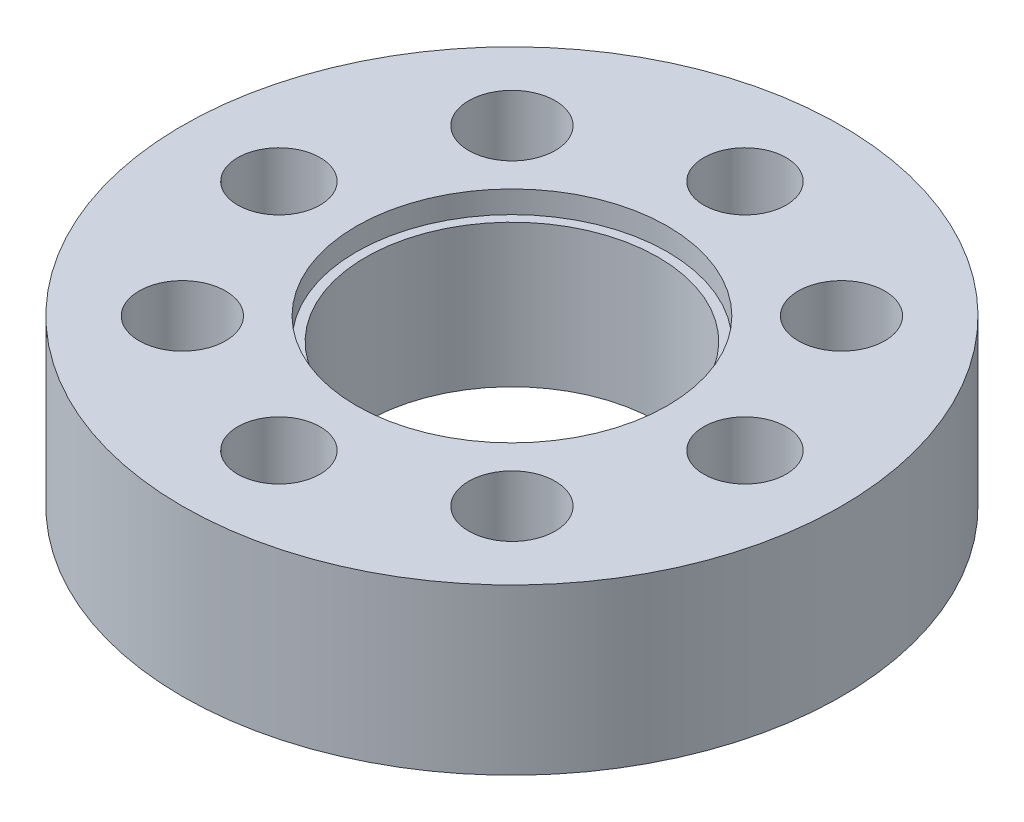
ISO-10303-21;
HEADER;
FILE_DESCRIPTION(('STEP AP214'),'2;1');
FILE_NAME('part.step','',(''),(''),'','','');
FILE_SCHEMA(('AUTOMOTIVE_DESIGN { 1 0 10303 214 1 1 1 1 }'));
ENDSEC;
DATA;
#1=APPLICATION_CONTEXT('core data for automotive mechanical design processes');
#2=APPLICATION_PROTOCOL_DEFINITION('international standard','automotive_design',2000,#1);
#3=PRODUCT_CONTEXT('',#1,'mechanical');
#4=PRODUCT('Part','Part','',(#3));
#5=PRODUCT_RELATED_PRODUCT_CATEGORY('part','',(#4));
#6=PRODUCT_DEFINITION_FORMATION('','',#4);
#7=PRODUCT_DEFINITION_CONTEXT('part definition',#1,'design');
#8=PRODUCT_DEFINITION('design','',#6,#7);
#9=PRODUCT_DEFINITION_SHAPE('','',#8);
#10=(LENGTH_UNIT() NAMED_UNIT(*) SI_UNIT(.MILLI.,.METRE.));
#11=(NAMED_UNIT(*) PLANE_ANGLE_UNIT() SI_UNIT($,.RADIAN.));
#12=(NAMED_UNIT(*) SI_UNIT($,.STERADIAN.) SOLID_ANGLE_UNIT());
#13=UNCERTAINTY_MEASURE_WITH_UNIT(LENGTH_MEASURE(1.E-05),#10,'distance_accuracy_value','');
#14=(GEOMETRIC_REPRESENTATION_CONTEXT(3) GLOBAL_UNCERTAINTY_ASSIGNED_CONTEXT((#13)) GLOBAL_UNIT_ASSIGNED_CONTEXT((#10,
#11,#12)) REPRESENTATION_CONTEXT('',''));
#15=CARTESIAN_POINT('',(0.,0.,0.));
#16=DIRECTION('',(0.,0.,1.));
#17=DIRECTION('',(1.,0.,0.));
#18=AXIS2_PLACEMENT_3D('',#15,#16,#17);
#19=CARTESIAN_POINT('',(0.,8.,0.));
#20=DIRECTION('',(0.,-1.,0.));
#21=DIRECTION('',(0.,0.,-1.));
#22=AXIS2_PLACEMENT_3D('',#19,#20,#21);
#23=CYLINDRICAL_SURFACE('',#22,7.1);
#24=CARTESIAN_POINT('',(0.,0.,0.));
#25=DIRECTION('',(0.,1.,0.));
#26=DIRECTION('',(0.,0.,1.));
#27=AXIS2_PLACEMENT_3D('',#24,#25,#26);
#28=CIRCLE('',#27,7.1);
#29=CARTESIAN_POINT('',(0.,0.,7.1));
#30=VERTEX_POINT('',#29);
#31=EDGE_CURVE('E49',#30,#30,#28,.T.);
#32=ORIENTED_EDGE('',*,*,#31,.F.);
#33=EDGE_LOOP('',(#32));
#34=FACE_BOUND('',#33,.T.);
#35=CARTESIAN_POINT('',(0.,6.92,0.));
#36=DIRECTION('',(0.,1.,0.));
#37=DIRECTION('',(0.,0.,1.));
#38=AXIS2_PLACEMENT_3D('',#35,#36,#37);
#39=CIRCLE('',#38,7.1);
#40=CARTESIAN_POINT('',(0.,6.92,7.1));
#41=VERTEX_POINT('',#40);
#42=EDGE_CURVE('E36',#41,#41,#39,.T.);
#43=ORIENTED_EDGE('',*,*,#42,.T.);
#44=EDGE_LOOP('',(#43));
#45=FACE_BOUND('',#44,.T.);
#46=ADVANCED_FACE('F33',(#34,#45),#23,.F.);
#47=CARTESIAN_POINT('',(-8.,8.,-8.));
#48=DIRECTION('',(0.,-1.,0.));
#49=DIRECTION('',(0.,0.,-1.));
#50=AXIS2_PLACEMENT_3D('',#47,#48,#49);
#51=CYLINDRICAL_SURFACE('',#50,2.1);
#52=CARTESIAN_POINT('',(-8.,8.,-8.));
#53=DIRECTION('',(0.,1.,0.));
#54=DIRECTION('',(0.,0.,1.));
#55=AXIS2_PLACEMENT_3D('',#52,#53,#54);
#56=CIRCLE('',#55,2.1);
#57=CARTESIAN_POINT('',(-8.,8.,-5.9));
#58=VERTEX_POINT('',#57);
#59=EDGE_CURVE('E40',#58,#58,#56,.T.);
#60=ORIENTED_EDGE('',*,*,#59,.T.);
#61=EDGE_LOOP('',(#60));
#62=FACE_BOUND('',#61,.T.);
#63=CARTESIAN_POINT('',(-8.,0.,-8.));
#64=DIRECTION('',(0.,1.,0.));
#65=DIRECTION('',(0.,0.,1.));
#66=AXIS2_PLACEMENT_3D('',#63,#64,#65);
#67=CIRCLE('',#66,2.1);
#68=CARTESIAN_POINT('',(-8.,0.,-5.9));
#69=VERTEX_POINT('',#68);
#70=EDGE_CURVE('E73',#69,#69,#67,.T.);
#71=ORIENTED_EDGE('',*,*,#70,.F.);
#72=EDGE_LOOP('',(#71));
#73=FACE_BOUND('',#72,.T.);
#74=ADVANCED_FACE('F117',(#62,#73),#51,.F.);
#75=CARTESIAN_POINT('',(8.,8.,-8.));
#76=DIRECTION('',(0.,-1.,0.));
#77=DIRECTION('',(0.,0.,-1.));
#78=AXIS2_PLACEMENT_3D('',#75,#76,#77);
#79=CYLINDRICAL_SURFACE('',#78,2.1);
#80=CARTESIAN_POINT('',(8.,8.,-8.));
#81=DIRECTION('',(0.,1.,0.));
#82=DIRECTION('',(0.,0.,1.));
#83=AXIS2_PLACEMENT_3D('',#80,#81,#82);
#84=CIRCLE('',#83,2.1);
#85=CARTESIAN_POINT('',(8.,8.,-5.9));
#86=VERTEX_POINT('',#85);
#87=EDGE_CURVE('E45',#86,#86,#84,.T.);
#88=ORIENTED_EDGE('',*,*,#87,.T.);
#89=EDGE_LOOP('',(#88));
#90=FACE_BOUND('',#89,.T.);
#91=CARTESIAN_POINT('',(8.,0.,-8.));
#92=DIRECTION('',(0.,1.,0.));
#93=DIRECTION('',(0.,0.,1.));
#94=AXIS2_PLACEMENT_3D('',#91,#92,#93);
#95=CIRCLE('',#94,2.1);
#96=CARTESIAN_POINT('',(8.,0.,-5.9));
#97=VERTEX_POINT('',#96);
#98=EDGE_CURVE('E70',#97,#97,#95,.T.);
#99=ORIENTED_EDGE('',*,*,#98,.F.);
#100=EDGE_LOOP('',(#99));
#101=FACE_BOUND('',#100,.T.);
#102=ADVANCED_FACE('F105',(#90,#101),#79,.F.);
#103=CARTESIAN_POINT('',(8.,8.,8.));
#104=DIRECTION('',(0.,-1.,0.));
#105=DIRECTION('',(0.,0.,-1.));
#106=AXIS2_PLACEMENT_3D('',#103,#104,#105);
#107=CYLINDRICAL_SURFACE('',#106,2.1);
#108=CARTESIAN_POINT('',(8.,8.,8.));
#109=DIRECTION('',(0.,1.,0.));
#110=DIRECTION('',(0.,0.,1.));
#111=AXIS2_PLACEMENT_3D('',#108,#109,#110);
#112=CIRCLE('',#111,2.1);
#113=CARTESIAN_POINT('',(8.,8.,10.1));
#114=VERTEX_POINT('',#113);
#115=EDGE_CURVE('E100',#114,#114,#112,.T.);
#116=ORIENTED_EDGE('',*,*,#115,.T.);
#117=EDGE_LOOP('',(#116));
#118=FACE_BOUND('',#117,.T.);
#119=CARTESIAN_POINT('',(8.,0.,8.));
#120=DIRECTION('',(0.,1.,0.));
#121=DIRECTION('',(0.,0.,1.));
#122=AXIS2_PLACEMENT_3D('',#119,#120,#121);
#123=CIRCLE('',#122,2.1);
#124=CARTESIAN_POINT('',(8.,0.,10.1));
#125=VERTEX_POINT('',#124);
#126=EDGE_CURVE('E67',#125,#125,#123,.T.);
#127=ORIENTED_EDGE('',*,*,#126,.F.);
#128=EDGE_LOOP('',(#127));
#129=FACE_BOUND('',#128,.T.);
#130=ADVANCED_FACE('F164',(#118,#129),#107,.F.);
#131=CARTESIAN_POINT('',(-8.,8.,8.));
#132=DIRECTION('',(0.,-1.,0.));
#133=DIRECTION('',(0.,0.,-1.));
#134=AXIS2_PLACEMENT_3D('',#131,#132,#133);
#135=CYLINDRICAL_SURFACE('',#134,2.1);
#136=CARTESIAN_POINT('',(-8.,8.,8.));
#137=DIRECTION('',(0.,1.,0.));
#138=DIRECTION('',(0.,0.,1.));
#139=AXIS2_PLACEMENT_3D('',#136,#137,#138);
#140=CIRCLE('',#139,2.1);
#141=CARTESIAN_POINT('',(-8.,8.,10.1));
#142=VERTEX_POINT('',#141);
#143=EDGE_CURVE('E97',#142,#142,#140,.T.);
#144=ORIENTED_EDGE('',*,*,#143,.T.);
#145=EDGE_LOOP('',(#144));
#146=FACE_BOUND('',#145,.T.);
#147=CARTESIAN_POINT('',(-8.,0.,8.));
#148=DIRECTION('',(0.,1.,0.));
#149=DIRECTION('',(0.,0.,1.));
#150=AXIS2_PLACEMENT_3D('',#147,#148,#149);
#151=CIRCLE('',#150,2.1);
#152=CARTESIAN_POINT('',(-8.,0.,10.1));
#153=VERTEX_POINT('',#152);
#154=EDGE_CURVE('E64',#153,#153,#151,.T.);
#155=ORIENTED_EDGE('',*,*,#154,.F.);
#156=EDGE_LOOP('',(#155));
#157=FACE_BOUND('',#156,.T.);
#158=ADVANCED_FACE('F167',(#146,#157),#135,.F.);
#159=CARTESIAN_POINT('',(11.3137084989851,8.,-1.38125347901227E-13));
#160=DIRECTION('',(0.,-1.,0.));
#161=DIRECTION('',(0.,0.,-1.));
#162=AXIS2_PLACEMENT_3D('',#159,#160,#161);
#163=CYLINDRICAL_SURFACE('',#162,2.);
#164=CARTESIAN_POINT('',(11.3137084989851,8.,-1.38125347901227E-13));
#165=DIRECTION('',(0.,1.,0.));
#166=DIRECTION('',(0.,0.,1.));
#167=AXIS2_PLACEMENT_3D('',#164,#165,#166);
#168=CIRCLE('',#167,2.);
#169=CARTESIAN_POINT('',(11.3137084989851,8.,1.99999999999986));
#170=VERTEX_POINT('',#169);
#171=EDGE_CURVE('E94',#170,#170,#168,.T.);
#172=ORIENTED_EDGE('',*,*,#171,.T.);
#173=EDGE_LOOP('',(#172));
#174=FACE_BOUND('',#173,.T.);
#175=CARTESIAN_POINT('',(11.3137084989851,0.,-1.38125347901227E-13));
#176=DIRECTION('',(0.,1.,0.));
#177=DIRECTION('',(0.,0.,1.));
#178=AXIS2_PLACEMENT_3D('',#175,#176,#177);
#179=CIRCLE('',#178,2.);
#180=CARTESIAN_POINT('',(11.3137084989851,0.,1.99999999999986));
#181=VERTEX_POINT('',#180);
#182=EDGE_CURVE('E61',#181,#181,#179,.T.);
#183=ORIENTED_EDGE('',*,*,#182,.F.);
#184=EDGE_LOOP('',(#183));
#185=FACE_BOUND('',#184,.T.);
#186=ADVANCED_FACE('F180',(#174,#185),#163,.F.);
#187=CARTESIAN_POINT('',(8.02868010259333E-13,8.,11.3137084989851));
#188=DIRECTION('',(0.,-1.,0.));
#189=DIRECTION('',(0.,0.,-1.));
#190=AXIS2_PLACEMENT_3D('',#187,#188,#189);
#191=CYLINDRICAL_SURFACE('',#190,2.);
#192=CARTESIAN_POINT('',(8.02868010259333E-13,8.,11.3137084989851));
#193=DIRECTION('',(0.,1.,0.));
#194=DIRECTION('',(0.,0.,1.));
#195=AXIS2_PLACEMENT_3D('',#192,#193,#194);
#196=CIRCLE('',#195,2.);
#197=CARTESIAN_POINT('',(8.02868010259333E-13,8.,13.3137084989851));
#198=VERTEX_POINT('',#197);
#199=EDGE_CURVE('E86',#198,#198,#196,.T.);
#200=ORIENTED_EDGE('',*,*,#199,.T.);
#201=EDGE_LOOP('',(#200));
#202=FACE_BOUND('',#201,.T.);
#203=CARTESIAN_POINT('',(8.02868010259333E-13,0.,11.3137084989851));
#204=DIRECTION('',(0.,1.,0.));
#205=DIRECTION('',(0.,0.,1.));
#206=AXIS2_PLACEMENT_3D('',#203,#204,#205);
#207=CIRCLE('',#206,2.);
#208=CARTESIAN_POINT('',(8.02868010259333E-13,0.,13.3137084989851));
#209=VERTEX_POINT('',#208);
#210=EDGE_CURVE('E58',#209,#209,#207,.T.);
#211=ORIENTED_EDGE('',*,*,#210,.F.);
#212=EDGE_LOOP('',(#211));
#213=FACE_BOUND('',#212,.T.);
#214=ADVANCED_FACE('F184',(#202,#213),#191,.F.);
#215=CARTESIAN_POINT('',(-11.3137084989844,8.,8.08939542425252E-13));
#216=DIRECTION('',(0.,-1.,0.));
#217=DIRECTION('',(0.,0.,-1.));
#218=AXIS2_PLACEMENT_3D('',#215,#216,#217);
#219=CYLINDRICAL_SURFACE('',#218,2.);
#220=CARTESIAN_POINT('',(-11.3137084989844,8.,8.08939542425252E-13));
#221=DIRECTION('',(0.,1.,0.));
#222=DIRECTION('',(0.,0.,1.));
#223=AXIS2_PLACEMENT_3D('',#220,#221,#222);
#224=CIRCLE('',#223,2.);
#225=CARTESIAN_POINT('',(-11.3137084989844,8.,2.00000000000081));
#226=VERTEX_POINT('',#225);
#227=EDGE_CURVE('E81',#226,#226,#224,.T.);
#228=ORIENTED_EDGE('',*,*,#227,.T.);
#229=EDGE_LOOP('',(#228));
#230=FACE_BOUND('',#229,.T.);
#231=CARTESIAN_POINT('',(-11.3137084989844,0.,8.08939542425252E-13));
#232=DIRECTION('',(0.,1.,0.));
#233=DIRECTION('',(0.,0.,1.));
#234=AXIS2_PLACEMENT_3D('',#231,#232,#233);
#235=CIRCLE('',#234,2.);
#236=CARTESIAN_POINT('',(-11.3137084989844,0.,2.00000000000081));
#237=VERTEX_POINT('',#236);
#238=EDGE_CURVE('E55',#237,#237,#235,.T.);
#239=ORIENTED_EDGE('',*,*,#238,.F.);
#240=EDGE_LOOP('',(#239));
#241=FACE_BOUND('',#240,.T.);
#242=ADVANCED_FACE('F188',(#230,#241),#219,.F.);
#243=CARTESIAN_POINT('',(-1.45407812864123E-13,8.,-11.3137084989844));
#244=DIRECTION('',(0.,-1.,0.));
#245=DIRECTION('',(0.,0.,-1.));
#246=AXIS2_PLACEMENT_3D('',#243,#244,#245);
#247=CYLINDRICAL_SURFACE('',#246,2.);
#248=CARTESIAN_POINT('',(-1.45407812864123E-13,8.,-11.3137084989844));
#249=DIRECTION('',(0.,1.,0.));
#250=DIRECTION('',(0.,0.,1.));
#251=AXIS2_PLACEMENT_3D('',#248,#249,#250);
#252=CIRCLE('',#251,2.);
#253=CARTESIAN_POINT('',(-1.45407812864123E-13,8.,-9.31370849898443));
#254=VERTEX_POINT('',#253);
#255=EDGE_CURVE('E77',#254,#254,#252,.T.);
#256=ORIENTED_EDGE('',*,*,#255,.T.);
#257=EDGE_LOOP('',(#256));
#258=FACE_BOUND('',#257,.T.);
#259=CARTESIAN_POINT('',(-1.45407812864123E-13,0.,-11.3137084989844));
#260=DIRECTION('',(0.,1.,0.));
#261=DIRECTION('',(0.,0.,1.));
#262=AXIS2_PLACEMENT_3D('',#259,#260,#261);
#263=CIRCLE('',#262,2.);
#264=CARTESIAN_POINT('',(-1.45407812864123E-13,0.,-9.31370849898443));
#265=VERTEX_POINT('',#264);
#266=EDGE_CURVE('E52',#265,#265,#263,.T.);
#267=ORIENTED_EDGE('',*,*,#266,.F.);
#268=EDGE_LOOP('',(#267));
#269=FACE_BOUND('',#268,.T.);
#270=ADVANCED_FACE('F191',(#258,#269),#247,.F.);
#271=CARTESIAN_POINT('',(0.,8.,0.));
#272=DIRECTION('',(0.,-1.,0.));
#273=DIRECTION('',(0.,0.,-1.));
#274=AXIS2_PLACEMENT_3D('',#271,#272,#273);
#275=CYLINDRICAL_SURFACE('',#274,16.);
#276=CARTESIAN_POINT('',(0.,8.,0.));
#277=DIRECTION('',(0.,1.,0.));
#278=DIRECTION('',(0.,0.,1.));
#279=AXIS2_PLACEMENT_3D('',#276,#277,#278);
#280=CIRCLE('',#279,16.);
#281=CARTESIAN_POINT('',(0.,8.,16.));
#282=VERTEX_POINT('',#281);
#283=EDGE_CURVE('E10',#282,#282,#280,.T.);
#284=ORIENTED_EDGE('',*,*,#283,.F.);
#285=EDGE_LOOP('',(#284));
#286=FACE_BOUND('',#285,.T.);
#287=CARTESIAN_POINT('',(0.,0.,0.));
#288=DIRECTION('',(0.,1.,0.));
#289=DIRECTION('',(0.,0.,1.));
#290=AXIS2_PLACEMENT_3D('',#287,#288,#289);
#291=CIRCLE('',#290,16.);
#292=CARTESIAN_POINT('',(0.,0.,16.));
#293=VERTEX_POINT('',#292);
#294=EDGE_CURVE('E75',#293,#293,#291,.T.);
#295=ORIENTED_EDGE('',*,*,#294,.T.);
#296=EDGE_LOOP('',(#295));
#297=FACE_BOUND('',#296,.T.);
#298=ADVANCED_FACE('F112',(#286,#297),#275,.T.);
#299=CARTESIAN_POINT('',(0.,8.,0.));
#300=DIRECTION('',(0.,1.,0.));
#301=DIRECTION('',(0.,0.,1.));
#302=AXIS2_PLACEMENT_3D('',#299,#300,#301);
#303=PLANE('',#302);
#304=CARTESIAN_POINT('',(0.,8.,0.));
#305=DIRECTION('',(0.,1.,0.));
#306=DIRECTION('',(0.,0.,1.));
#307=AXIS2_PLACEMENT_3D('',#304,#305,#306);
#308=CIRCLE('',#307,7.55);
#309=CARTESIAN_POINT('',(0.,8.,7.55));
#310=VERTEX_POINT('',#309);
#311=EDGE_CURVE('E89',#310,#310,#308,.T.);
#312=ORIENTED_EDGE('',*,*,#311,.F.);
#313=EDGE_LOOP('',(#312));
#314=FACE_BOUND('',#313,.T.);
#315=ORIENTED_EDGE('',*,*,#255,.F.);
#316=EDGE_LOOP('',(#315));
#317=FACE_BOUND('',#316,.T.);
#318=ORIENTED_EDGE('',*,*,#227,.F.);
#319=EDGE_LOOP('',(#318));
#320=FACE_BOUND('',#319,.T.);
#321=ORIENTED_EDGE('',*,*,#199,.F.);
#322=EDGE_LOOP('',(#321));
#323=FACE_BOUND('',#322,.T.);
#324=ORIENTED_EDGE('',*,*,#171,.F.);
#325=EDGE_LOOP('',(#324));
#326=FACE_BOUND('',#325,.T.);
#327=ORIENTED_EDGE('',*,*,#143,.F.);
#328=EDGE_LOOP('',(#327));
#329=FACE_BOUND('',#328,.T.);
#330=ORIENTED_EDGE('',*,*,#115,.F.);
#331=EDGE_LOOP('',(#330));
#332=FACE_BOUND('',#331,.T.);
#333=ORIENTED_EDGE('',*,*,#87,.F.);
#334=EDGE_LOOP('',(#333));
#335=FACE_BOUND('',#334,.T.);
#336=ORIENTED_EDGE('',*,*,#59,.F.);
#337=EDGE_LOOP('',(#336));
#338=FACE_BOUND('',#337,.T.);
#339=ORIENTED_EDGE('',*,*,#283,.T.);
#340=EDGE_LOOP('',(#339));
#341=FACE_BOUND('',#340,.T.);
#342=ADVANCED_FACE('F108',(#314,#317,#320,#323,#326,#329,#332,#335,#338,#341),#303,.T.);
#343=CARTESIAN_POINT('',(0.,0.,0.));
#344=DIRECTION('',(0.,1.,0.));
#345=DIRECTION('',(0.,0.,1.));
#346=AXIS2_PLACEMENT_3D('',#343,#344,#345);
#347=PLANE('',#346);
#348=ORIENTED_EDGE('',*,*,#31,.T.);
#349=EDGE_LOOP('',(#348));
#350=FACE_BOUND('',#349,.T.);
#351=ORIENTED_EDGE('',*,*,#266,.T.);
#352=EDGE_LOOP('',(#351));
#353=FACE_BOUND('',#352,.T.);
#354=ORIENTED_EDGE('',*,*,#238,.T.);
#355=EDGE_LOOP('',(#354));
#356=FACE_BOUND('',#355,.T.);
#357=ORIENTED_EDGE('',*,*,#210,.T.);
#358=EDGE_LOOP('',(#357));
#359=FACE_BOUND('',#358,.T.);
#360=ORIENTED_EDGE('',*,*,#182,.T.);
#361=EDGE_LOOP('',(#360));
#362=FACE_BOUND('',#361,.T.);
#363=ORIENTED_EDGE('',*,*,#154,.T.);
#364=EDGE_LOOP('',(#363));
#365=FACE_BOUND('',#364,.T.);
#366=ORIENTED_EDGE('',*,*,#126,.T.);
#367=EDGE_LOOP('',(#366));
#368=FACE_BOUND('',#367,.T.);
#369=ORIENTED_EDGE('',*,*,#98,.T.);
#370=EDGE_LOOP('',(#369));
#371=FACE_BOUND('',#370,.T.);
#372=ORIENTED_EDGE('',*,*,#70,.T.);
#373=EDGE_LOOP('',(#372));
#374=FACE_BOUND('',#373,.T.);
#375=ORIENTED_EDGE('',*,*,#294,.F.);
#376=EDGE_LOOP('',(#375));
#377=FACE_BOUND('',#376,.T.);
#378=ADVANCED_FACE('F111',(#350,#353,#356,#359,#362,#365,#368,#371,#374,#377),#347,.F.);
#379=CARTESIAN_POINT('',(0.,6.92,0.));
#380=DIRECTION('',(0.,1.,0.));
#381=DIRECTION('',(0.,0.,1.));
#382=AXIS2_PLACEMENT_3D('',#379,#380,#381);
#383=CYLINDRICAL_SURFACE('',#382,7.55);
#384=CARTESIAN_POINT('',(0.,6.92,0.));
#385=DIRECTION('',(0.,1.,0.));
#386=DIRECTION('',(0.,0.,1.));
#387=AXIS2_PLACEMENT_3D('',#384,#385,#386);
#388=CIRCLE('',#387,7.55);
#389=CARTESIAN_POINT('',(0.,6.92,7.55));
#390=VERTEX_POINT('',#389);
#391=EDGE_CURVE('E145',#390,#390,#388,.T.);
#392=ORIENTED_EDGE('',*,*,#391,.F.);
#393=EDGE_LOOP('',(#392));
#394=FACE_BOUND('',#393,.T.);
#395=ORIENTED_EDGE('',*,*,#311,.T.);
#396=EDGE_LOOP('',(#395));
#397=FACE_BOUND('',#396,.T.);
#398=ADVANCED_FACE('F125',(#394,#397),#383,.F.);
#399=CARTESIAN_POINT('',(0.,6.92,0.));
#400=DIRECTION('',(0.,1.,0.));
#401=DIRECTION('',(0.,0.,1.));
#402=AXIS2_PLACEMENT_3D('',#399,#400,#401);
#403=PLANE('',#402);
#404=ORIENTED_EDGE('',*,*,#42,.F.);
#405=EDGE_LOOP('',(#404));
#406=FACE_BOUND('',#405,.T.);
#407=ORIENTED_EDGE('',*,*,#391,.T.);
#408=EDGE_LOOP('',(#407));
#409=FACE_BOUND('',#408,.T.);
#410=ADVANCED_FACE('F131',(#406,#409),#403,.T.);
#411=CLOSED_SHELL('',(#46,#74,#102,#130,#158,#186,#214,#242,#270,#298,#342,#378,#398,#410));
#412=MANIFOLD_SOLID_BREP('B2',#411);
#413=ADVANCED_BREP_SHAPE_REPRESENTATION('',(#18,#412),#14);
#414=SHAPE_DEFINITION_REPRESENTATION(#9,#413);
ENDSEC;
END-ISO-10303-21;
